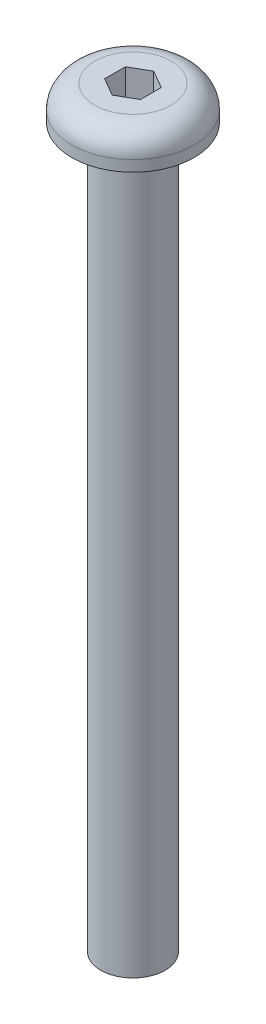
ISO-10303-21;
HEADER;
FILE_DESCRIPTION(('STEP AP214'),'2;1');
FILE_NAME('part.step','',(''),(''),'','','');
FILE_SCHEMA(('AUTOMOTIVE_DESIGN { 1 0 10303 214 1 1 1 1 }'));
ENDSEC;
DATA;
#1=APPLICATION_CONTEXT('core data for automotive mechanical design processes');
#2=APPLICATION_PROTOCOL_DEFINITION('international standard','automotive_design',2000,#1);
#3=PRODUCT_CONTEXT('',#1,'mechanical');
#4=PRODUCT('Part','Part','',(#3));
#5=PRODUCT_RELATED_PRODUCT_CATEGORY('part','',(#4));
#6=PRODUCT_DEFINITION_FORMATION('','',#4);
#7=PRODUCT_DEFINITION_CONTEXT('part definition',#1,'design');
#8=PRODUCT_DEFINITION('design','',#6,#7);
#9=PRODUCT_DEFINITION_SHAPE('','',#8);
#10=(LENGTH_UNIT() NAMED_UNIT(*) SI_UNIT(.MILLI.,.METRE.));
#11=(NAMED_UNIT(*) PLANE_ANGLE_UNIT() SI_UNIT($,.RADIAN.));
#12=(NAMED_UNIT(*) SI_UNIT($,.STERADIAN.) SOLID_ANGLE_UNIT());
#13=UNCERTAINTY_MEASURE_WITH_UNIT(LENGTH_MEASURE(1.E-05),#10,'distance_accuracy_value','');
#14=(GEOMETRIC_REPRESENTATION_CONTEXT(3) GLOBAL_UNCERTAINTY_ASSIGNED_CONTEXT((#13)) GLOBAL_UNIT_ASSIGNED_CONTEXT((#10,
#11,#12)) REPRESENTATION_CONTEXT('',''));
#15=CARTESIAN_POINT('',(0.,0.,0.));
#16=DIRECTION('',(0.,0.,1.));
#17=DIRECTION('',(1.,0.,0.));
#18=AXIS2_PLACEMENT_3D('',#15,#16,#17);
#19=CARTESIAN_POINT('',(0.,31.75,0.));
#20=DIRECTION('',(0.,-1.,0.));
#21=DIRECTION('',(0.,0.,-1.));
#22=AXIS2_PLACEMENT_3D('',#19,#20,#21);
#23=CYLINDRICAL_SURFACE('',#22,1.4224);
#24=CARTESIAN_POINT('',(0.,31.75,0.));
#25=DIRECTION('',(0.,1.,0.));
#26=DIRECTION('',(0.,0.,1.));
#27=AXIS2_PLACEMENT_3D('',#24,#25,#26);
#28=CIRCLE('',#27,1.4224);
#29=CARTESIAN_POINT('',(0.,31.75,1.4224));
#30=VERTEX_POINT('',#29);
#31=EDGE_CURVE('E141',#30,#30,#28,.T.);
#32=ORIENTED_EDGE('',*,*,#31,.F.);
#33=EDGE_LOOP('',(#32));
#34=FACE_BOUND('',#33,.T.);
#35=CARTESIAN_POINT('',(0.,0.,0.));
#36=DIRECTION('',(0.,1.,0.));
#37=DIRECTION('',(0.,0.,1.));
#38=AXIS2_PLACEMENT_3D('',#35,#36,#37);
#39=CIRCLE('',#38,1.4224);
#40=CARTESIAN_POINT('',(0.,0.,1.4224));
#41=VERTEX_POINT('',#40);
#42=EDGE_CURVE('E140',#41,#41,#39,.T.);
#43=ORIENTED_EDGE('',*,*,#42,.T.);
#44=EDGE_LOOP('',(#43));
#45=FACE_BOUND('',#44,.T.);
#46=ADVANCED_FACE('F30',(#34,#45),#23,.T.);
#47=CARTESIAN_POINT('',(0.,0.,0.));
#48=DIRECTION('',(0.,1.,0.));
#49=DIRECTION('',(0.,0.,1.));
#50=AXIS2_PLACEMENT_3D('',#47,#48,#49);
#51=PLANE('',#50);
#52=ORIENTED_EDGE('',*,*,#42,.F.);
#53=EDGE_LOOP('',(#52));
#54=FACE_BOUND('',#53,.T.);
#55=ADVANCED_FACE('F164',(#54),#51,.F.);
#56=CARTESIAN_POINT('',(0.,31.75,0.));
#57=DIRECTION('',(0.,1.,0.));
#58=DIRECTION('',(0.,0.,1.));
#59=AXIS2_PLACEMENT_3D('',#56,#57,#58);
#60=PLANE('',#59);
#61=CARTESIAN_POINT('',(0.,31.75,0.));
#62=DIRECTION('',(0.,1.,0.));
#63=DIRECTION('',(0.,0.,1.));
#64=AXIS2_PLACEMENT_3D('',#61,#62,#63);
#65=CIRCLE('',#64,2.7051);
#66=CARTESIAN_POINT('',(0.,31.75,2.7051));
#67=VERTEX_POINT('',#66);
#68=EDGE_CURVE('E132',#67,#67,#65,.T.);
#69=ORIENTED_EDGE('',*,*,#68,.F.);
#70=EDGE_LOOP('',(#69));
#71=FACE_BOUND('',#70,.T.);
#72=ORIENTED_EDGE('',*,*,#31,.T.);
#73=EDGE_LOOP('',(#72));
#74=FACE_BOUND('',#73,.T.);
#75=ADVANCED_FACE('F169',(#71,#74),#60,.F.);
#76=CARTESIAN_POINT('',(0.,33.2486,0.));
#77=DIRECTION('',(0.,-1.,0.));
#78=DIRECTION('',(0.,0.,-1.));
#79=AXIS2_PLACEMENT_3D('',#76,#77,#78);
#80=CYLINDRICAL_SURFACE('',#79,2.7051);
#81=CARTESIAN_POINT('',(0.,32.2326,0.));
#82=DIRECTION('',(0.,1.,0.));
#83=DIRECTION('',(0.,0.,1.));
#84=AXIS2_PLACEMENT_3D('',#81,#82,#83);
#85=CIRCLE('',#84,2.7051);
#86=CARTESIAN_POINT('',(0.,32.2326,2.7051));
#87=VERTEX_POINT('',#86);
#88=EDGE_CURVE('E11',#87,#87,#85,.F.);
#89=ORIENTED_EDGE('',*,*,#88,.T.);
#90=EDGE_LOOP('',(#89));
#91=FACE_BOUND('',#90,.T.);
#92=ORIENTED_EDGE('',*,*,#68,.T.);
#93=EDGE_LOOP('',(#92));
#94=FACE_BOUND('',#93,.T.);
#95=ADVANCED_FACE('F159',(#91,#94),#80,.T.);
#96=CARTESIAN_POINT('',(0.,33.2486,0.));
#97=DIRECTION('',(0.,1.,0.));
#98=DIRECTION('',(0.,0.,1.));
#99=AXIS2_PLACEMENT_3D('',#96,#97,#98);
#100=PLANE('',#99);
#101=DIRECTION('',(-0.866025403784438,0.,-0.5));
#102=VECTOR('',#101,1.);
#103=CARTESIAN_POINT('',(0.79375,33.2486,-0.458271776169266));
#104=LINE('',#103,#102);
#105=CARTESIAN_POINT('',(0.79375,33.2486,-0.458271776169266));
#106=VERTEX_POINT('',#105);
#107=CARTESIAN_POINT('',(0.,33.2486,-0.916543552338531));
#108=VERTEX_POINT('',#107);
#109=EDGE_CURVE('E45',#106,#108,#104,.T.);
#110=ORIENTED_EDGE('',*,*,#109,.F.);
#111=DIRECTION('',(0.,0.,-1.));
#112=VECTOR('',#111,1.);
#113=CARTESIAN_POINT('',(0.79375,33.2486,0.458271776169266));
#114=LINE('',#113,#112);
#115=CARTESIAN_POINT('',(0.79375,33.2486,0.458271776169266));
#116=VERTEX_POINT('',#115);
#117=EDGE_CURVE('E128',#116,#106,#114,.T.);
#118=ORIENTED_EDGE('',*,*,#117,.F.);
#119=DIRECTION('',(0.866025403784439,0.,-0.5));
#120=VECTOR('',#119,1.);
#121=CARTESIAN_POINT('',(0.,33.2486,0.916543552338531));
#122=LINE('',#121,#120);
#123=CARTESIAN_POINT('',(0.,33.2486,0.916543552338531));
#124=VERTEX_POINT('',#123);
#125=EDGE_CURVE('E126',#124,#116,#122,.T.);
#126=ORIENTED_EDGE('',*,*,#125,.F.);
#127=DIRECTION('',(0.866025403784439,0.,0.5));
#128=VECTOR('',#127,1.);
#129=CARTESIAN_POINT('',(-0.79375,33.2486,0.458271776169265));
#130=LINE('',#129,#128);
#131=CARTESIAN_POINT('',(-0.79375,33.2486,0.458271776169265));
#132=VERTEX_POINT('',#131);
#133=EDGE_CURVE('E93',#132,#124,#130,.T.);
#134=ORIENTED_EDGE('',*,*,#133,.F.);
#135=DIRECTION('',(0.,0.,1.));
#136=VECTOR('',#135,1.);
#137=CARTESIAN_POINT('',(-0.79375,33.2486,-0.458271776169265));
#138=LINE('',#137,#136);
#139=CARTESIAN_POINT('',(-0.79375,33.2486,-0.458271776169265));
#140=VERTEX_POINT('',#139);
#141=EDGE_CURVE('E122',#140,#132,#138,.T.);
#142=ORIENTED_EDGE('',*,*,#141,.F.);
#143=DIRECTION('',(-0.866025403784438,0.,0.5));
#144=VECTOR('',#143,1.);
#145=CARTESIAN_POINT('',(0.,33.2486,-0.916543552338531));
#146=LINE('',#145,#144);
#147=EDGE_CURVE('E119',#108,#140,#146,.T.);
#148=ORIENTED_EDGE('',*,*,#147,.F.);
#149=EDGE_LOOP('',(#110,#118,#126,#134,#142,#148));
#150=FACE_BOUND('',#149,.T.);
#151=CARTESIAN_POINT('',(0.,33.2486,0.));
#152=DIRECTION('',(0.,1.,0.));
#153=DIRECTION('',(0.,0.,1.));
#154=AXIS2_PLACEMENT_3D('',#151,#152,#153);
#155=CIRCLE('',#154,1.6891);
#156=CARTESIAN_POINT('',(0.,33.2486,1.6891));
#157=VERTEX_POINT('',#156);
#158=EDGE_CURVE('E38',#157,#157,#155,.T.);
#159=ORIENTED_EDGE('',*,*,#158,.T.);
#160=EDGE_LOOP('',(#159));
#161=FACE_BOUND('',#160,.T.);
#162=ADVANCED_FACE('F148',(#150,#161),#100,.T.);
#163=CARTESIAN_POINT('',(0.,32.2326,0.));
#164=DIRECTION('',(0.,1.,0.));
#165=DIRECTION('',(0.,0.,1.));
#166=AXIS2_PLACEMENT_3D('',#163,#164,#165);
#167=TOROIDAL_SURFACE('',#166,1.6891,1.016);
#168=ORIENTED_EDGE('',*,*,#88,.F.);
#169=EDGE_LOOP('',(#168));
#170=FACE_BOUND('',#169,.T.);
#171=ORIENTED_EDGE('',*,*,#158,.F.);
#172=EDGE_LOOP('',(#171));
#173=FACE_BOUND('',#172,.T.);
#174=ADVANCED_FACE('F32',(#170,#173),#167,.T.);
#175=CARTESIAN_POINT('',(0.79375,30.86735,-0.458271776169266));
#176=DIRECTION('',(0.5,0.,-0.866025403784439));
#177=DIRECTION('',(-0.866025403784438,0.,-0.5));
#178=AXIS2_PLACEMENT_3D('',#175,#176,#177);
#179=PLANE('',#178);
#180=ORIENTED_EDGE('',*,*,#109,.T.);
#181=DIRECTION('',(0.,1.,0.));
#182=VECTOR('',#181,1.);
#183=CARTESIAN_POINT('',(0.,30.86735,-0.916543552338531));
#184=LINE('',#183,#182);
#185=CARTESIAN_POINT('',(0.,30.86735,-0.916543552338531));
#186=VERTEX_POINT('',#185);
#187=EDGE_CURVE('E75',#186,#108,#184,.T.);
#188=ORIENTED_EDGE('',*,*,#187,.F.);
#189=DIRECTION('',(-0.866025403784438,0.,-0.5));
#190=VECTOR('',#189,1.);
#191=CARTESIAN_POINT('',(0.79375,30.86735,-0.458271776169266));
#192=LINE('',#191,#190);
#193=CARTESIAN_POINT('',(0.79375,30.86735,-0.458271776169266));
#194=VERTEX_POINT('',#193);
#195=EDGE_CURVE('E130',#194,#186,#192,.T.);
#196=ORIENTED_EDGE('',*,*,#195,.F.);
#197=DIRECTION('',(0.,1.,0.));
#198=VECTOR('',#197,1.);
#199=CARTESIAN_POINT('',(0.79375,30.86735,-0.458271776169266));
#200=LINE('',#199,#198);
#201=EDGE_CURVE('E53',#194,#106,#200,.T.);
#202=ORIENTED_EDGE('',*,*,#201,.T.);
#203=EDGE_LOOP('',(#180,#188,#196,#202));
#204=FACE_BOUND('',#203,.T.);
#205=ADVANCED_FACE('F151',(#204),#179,.F.);
#206=CARTESIAN_POINT('',(0.79375,30.86735,0.458271776169266));
#207=DIRECTION('',(1.,0.,0.));
#208=DIRECTION('',(0.,0.,-1.));
#209=AXIS2_PLACEMENT_3D('',#206,#207,#208);
#210=PLANE('',#209);
#211=ORIENTED_EDGE('',*,*,#117,.T.);
#212=ORIENTED_EDGE('',*,*,#201,.F.);
#213=DIRECTION('',(0.,0.,-1.));
#214=VECTOR('',#213,1.);
#215=CARTESIAN_POINT('',(0.79375,30.86735,0.458271776169266));
#216=LINE('',#215,#214);
#217=CARTESIAN_POINT('',(0.79375,30.86735,0.458271776169266));
#218=VERTEX_POINT('',#217);
#219=EDGE_CURVE('E105',#218,#194,#216,.T.);
#220=ORIENTED_EDGE('',*,*,#219,.F.);
#221=DIRECTION('',(0.,1.,0.));
#222=VECTOR('',#221,1.);
#223=CARTESIAN_POINT('',(0.79375,30.86735,0.458271776169266));
#224=LINE('',#223,#222);
#225=EDGE_CURVE('E97',#218,#116,#224,.T.);
#226=ORIENTED_EDGE('',*,*,#225,.T.);
#227=EDGE_LOOP('',(#211,#212,#220,#226));
#228=FACE_BOUND('',#227,.T.);
#229=ADVANCED_FACE('F157',(#228),#210,.F.);
#230=CARTESIAN_POINT('',(0.,30.86735,0.916543552338531));
#231=DIRECTION('',(0.5,0.,0.866025403784439));
#232=DIRECTION('',(0.866025403784439,0.,-0.5));
#233=AXIS2_PLACEMENT_3D('',#230,#231,#232);
#234=PLANE('',#233);
#235=ORIENTED_EDGE('',*,*,#125,.T.);
#236=ORIENTED_EDGE('',*,*,#225,.F.);
#237=DIRECTION('',(0.866025403784439,0.,-0.5));
#238=VECTOR('',#237,1.);
#239=CARTESIAN_POINT('',(0.,30.86735,0.916543552338531));
#240=LINE('',#239,#238);
#241=CARTESIAN_POINT('',(0.,30.86735,0.916543552338531));
#242=VERTEX_POINT('',#241);
#243=EDGE_CURVE('E101',#242,#218,#240,.T.);
#244=ORIENTED_EDGE('',*,*,#243,.F.);
#245=DIRECTION('',(0.,1.,0.));
#246=VECTOR('',#245,1.);
#247=CARTESIAN_POINT('',(0.,30.86735,0.916543552338531));
#248=LINE('',#247,#246);
#249=EDGE_CURVE('E86',#242,#124,#248,.T.);
#250=ORIENTED_EDGE('',*,*,#249,.T.);
#251=EDGE_LOOP('',(#235,#236,#244,#250));
#252=FACE_BOUND('',#251,.T.);
#253=ADVANCED_FACE('F102',(#252),#234,.F.);
#254=CARTESIAN_POINT('',(-0.79375,30.86735,0.458271776169265));
#255=DIRECTION('',(-0.5,0.,0.866025403784439));
#256=DIRECTION('',(0.866025403784438,0.,0.5));
#257=AXIS2_PLACEMENT_3D('',#254,#255,#256);
#258=PLANE('',#257);
#259=ORIENTED_EDGE('',*,*,#133,.T.);
#260=ORIENTED_EDGE('',*,*,#249,.F.);
#261=DIRECTION('',(0.866025403784439,0.,0.5));
#262=VECTOR('',#261,1.);
#263=CARTESIAN_POINT('',(-0.79375,30.86735,0.458271776169265));
#264=LINE('',#263,#262);
#265=CARTESIAN_POINT('',(-0.79375,30.86735,0.458271776169265));
#266=VERTEX_POINT('',#265);
#267=EDGE_CURVE('E90',#266,#242,#264,.T.);
#268=ORIENTED_EDGE('',*,*,#267,.F.);
#269=DIRECTION('',(0.,1.,0.));
#270=VECTOR('',#269,1.);
#271=CARTESIAN_POINT('',(-0.79375,30.86735,0.458271776169265));
#272=LINE('',#271,#270);
#273=EDGE_CURVE('E98',#266,#132,#272,.T.);
#274=ORIENTED_EDGE('',*,*,#273,.T.);
#275=EDGE_LOOP('',(#259,#260,#268,#274));
#276=FACE_BOUND('',#275,.T.);
#277=ADVANCED_FACE('F88',(#276),#258,.F.);
#278=CARTESIAN_POINT('',(-0.79375,30.86735,-0.458271776169265));
#279=DIRECTION('',(-1.,0.,0.));
#280=DIRECTION('',(0.,0.,1.));
#281=AXIS2_PLACEMENT_3D('',#278,#279,#280);
#282=PLANE('',#281);
#283=ORIENTED_EDGE('',*,*,#141,.T.);
#284=ORIENTED_EDGE('',*,*,#273,.F.);
#285=DIRECTION('',(0.,0.,1.));
#286=VECTOR('',#285,1.);
#287=CARTESIAN_POINT('',(-0.79375,30.86735,-0.458271776169265));
#288=LINE('',#287,#286);
#289=CARTESIAN_POINT('',(-0.79375,30.86735,-0.458271776169265));
#290=VERTEX_POINT('',#289);
#291=EDGE_CURVE('E111',#290,#266,#288,.T.);
#292=ORIENTED_EDGE('',*,*,#291,.F.);
#293=DIRECTION('',(0.,1.,0.));
#294=VECTOR('',#293,1.);
#295=CARTESIAN_POINT('',(-0.79375,30.86735,-0.458271776169265));
#296=LINE('',#295,#294);
#297=EDGE_CURVE('E135',#290,#140,#296,.T.);
#298=ORIENTED_EDGE('',*,*,#297,.T.);
#299=EDGE_LOOP('',(#283,#284,#292,#298));
#300=FACE_BOUND('',#299,.T.);
#301=ADVANCED_FACE('F184',(#300),#282,.F.);
#302=CARTESIAN_POINT('',(0.,30.86735,-0.916543552338531));
#303=DIRECTION('',(-0.5,0.,-0.866025403784439));
#304=DIRECTION('',(-0.866025403784438,0.,0.5));
#305=AXIS2_PLACEMENT_3D('',#302,#303,#304);
#306=PLANE('',#305);
#307=ORIENTED_EDGE('',*,*,#147,.T.);
#308=ORIENTED_EDGE('',*,*,#297,.F.);
#309=DIRECTION('',(-0.866025403784438,0.,0.5));
#310=VECTOR('',#309,1.);
#311=CARTESIAN_POINT('',(0.,30.86735,-0.916543552338531));
#312=LINE('',#311,#310);
#313=EDGE_CURVE('E113',#186,#290,#312,.T.);
#314=ORIENTED_EDGE('',*,*,#313,.F.);
#315=ORIENTED_EDGE('',*,*,#187,.T.);
#316=EDGE_LOOP('',(#307,#308,#314,#315));
#317=FACE_BOUND('',#316,.T.);
#318=ADVANCED_FACE('F181',(#317),#306,.F.);
#319=CARTESIAN_POINT('',(0.,30.86735,-0.916543552338531));
#320=DIRECTION('',(0.,1.,0.));
#321=DIRECTION('',(0.,0.,1.));
#322=AXIS2_PLACEMENT_3D('',#319,#320,#321);
#323=PLANE('',#322);
#324=ORIENTED_EDGE('',*,*,#195,.T.);
#325=ORIENTED_EDGE('',*,*,#313,.T.);
#326=ORIENTED_EDGE('',*,*,#291,.T.);
#327=ORIENTED_EDGE('',*,*,#267,.T.);
#328=ORIENTED_EDGE('',*,*,#243,.T.);
#329=ORIENTED_EDGE('',*,*,#219,.T.);
#330=EDGE_LOOP('',(#324,#325,#326,#327,#328,#329));
#331=FACE_BOUND('',#330,.T.);
#332=ADVANCED_FACE('F108',(#331),#323,.T.);
#333=CLOSED_SHELL('',(#46,#55,#75,#95,#162,#174,#205,#229,#253,#277,#301,#318,#332));
#334=MANIFOLD_SOLID_BREP('B2',#333);
#335=ADVANCED_BREP_SHAPE_REPRESENTATION('',(#18,#334),#14);
#336=SHAPE_DEFINITION_REPRESENTATION(#9,#335);
ENDSEC;
END-ISO-10303-21;
